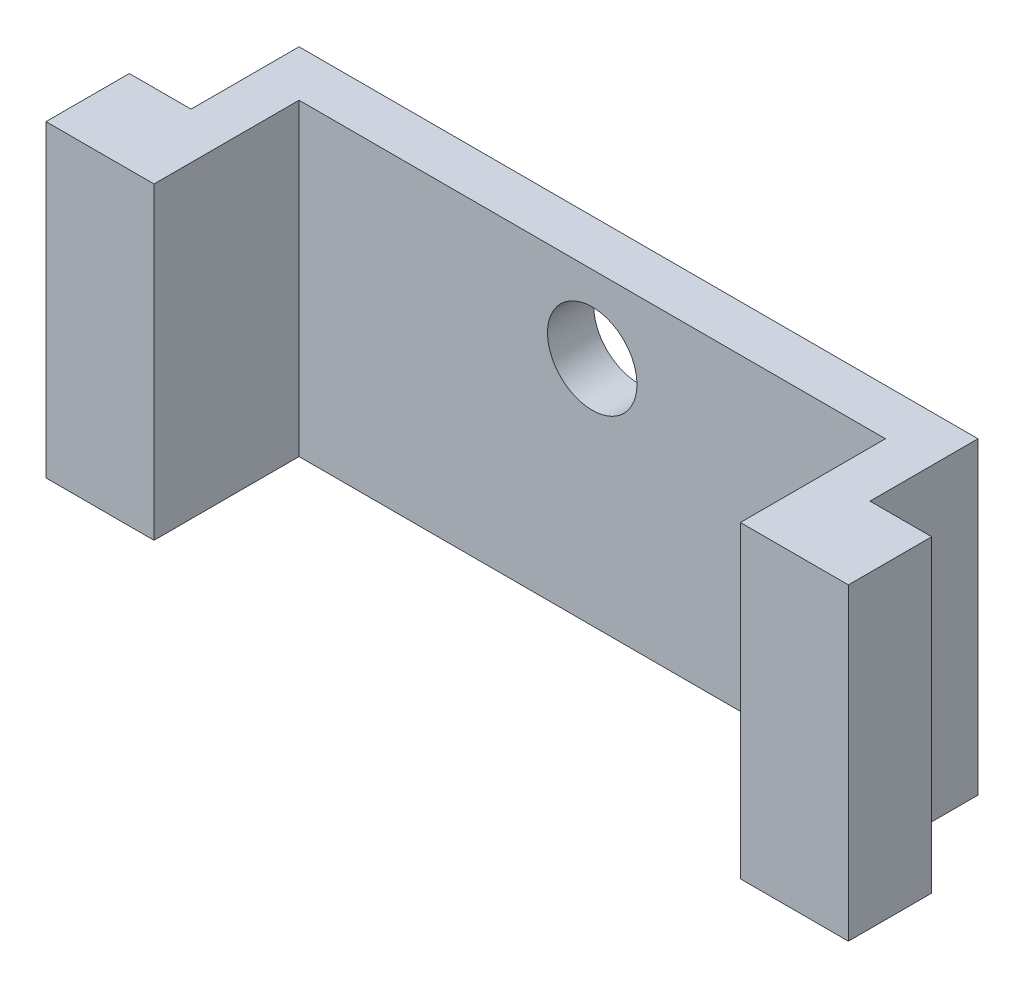
ISO-10303-21;
HEADER;
FILE_DESCRIPTION(('STEP AP214'),'2;1');
FILE_NAME('part.step','',(''),(''),'','','');
FILE_SCHEMA(('AUTOMOTIVE_DESIGN { 1 0 10303 214 1 1 1 1 }'));
ENDSEC;
DATA;
#1=APPLICATION_CONTEXT('core data for automotive mechanical design processes');
#2=APPLICATION_PROTOCOL_DEFINITION('international standard','automotive_design',2000,#1);
#3=PRODUCT_CONTEXT('',#1,'mechanical');
#4=PRODUCT('Part','Part','',(#3));
#5=PRODUCT_RELATED_PRODUCT_CATEGORY('part','',(#4));
#6=PRODUCT_DEFINITION_FORMATION('','',#4);
#7=PRODUCT_DEFINITION_CONTEXT('part definition',#1,'design');
#8=PRODUCT_DEFINITION('design','',#6,#7);
#9=PRODUCT_DEFINITION_SHAPE('','',#8);
#10=(LENGTH_UNIT() NAMED_UNIT(*) SI_UNIT(.MILLI.,.METRE.));
#11=(NAMED_UNIT(*) PLANE_ANGLE_UNIT() SI_UNIT($,.RADIAN.));
#12=(NAMED_UNIT(*) SI_UNIT($,.STERADIAN.) SOLID_ANGLE_UNIT());
#13=UNCERTAINTY_MEASURE_WITH_UNIT(LENGTH_MEASURE(1.E-05),#10,'distance_accuracy_value','');
#14=(GEOMETRIC_REPRESENTATION_CONTEXT(3) GLOBAL_UNCERTAINTY_ASSIGNED_CONTEXT((#13)) GLOBAL_UNIT_ASSIGNED_CONTEXT((#10,
#11,#12)) REPRESENTATION_CONTEXT('',''));
#15=CARTESIAN_POINT('',(0.,0.,0.));
#16=DIRECTION('',(0.,0.,1.));
#17=DIRECTION('',(1.,0.,0.));
#18=AXIS2_PLACEMENT_3D('',#15,#16,#17);
#19=CARTESIAN_POINT('',(0.,5.,5.15679442508711));
#20=DIRECTION('',(0.,0.,-1.));
#21=DIRECTION('',(-1.,0.,0.));
#22=AXIS2_PLACEMENT_3D('',#19,#20,#21);
#23=PLANE('',#22);
#24=CARTESIAN_POINT('',(6.45644599303137,2.5,5.15679442508711));
#25=DIRECTION('',(0.,0.,1.));
#26=DIRECTION('',(1.,0.,0.));
#27=AXIS2_PLACEMENT_3D('',#24,#25,#26);
#28=CIRCLE('',#27,1.45);
#29=CARTESIAN_POINT('',(7.90644599303137,2.5,5.15679442508711));
#30=VERTEX_POINT('',#29);
#31=EDGE_CURVE('E191',#30,#30,#28,.T.);
#32=ORIENTED_EDGE('',*,*,#31,.F.);
#33=EDGE_LOOP('',(#32));
#34=FACE_BOUND('',#33,.T.);
#35=DIRECTION('',(0.,-1.,0.));
#36=VECTOR('',#35,1.);
#37=CARTESIAN_POINT('',(-3.04355400696863,5.,5.15679442508711));
#38=LINE('',#37,#36);
#39=CARTESIAN_POINT('',(-3.04355400696863,5.,5.15679442508711));
#40=VERTEX_POINT('',#39);
#41=CARTESIAN_POINT('',(-3.04355400696863,-5.,5.15679442508711));
#42=VERTEX_POINT('',#41);
#43=EDGE_CURVE('E58',#40,#42,#38,.T.);
#44=ORIENTED_EDGE('',*,*,#43,.T.);
#45=DIRECTION('',(-1.,0.,0.));
#46=VECTOR('',#45,1.);
#47=CARTESIAN_POINT('',(15.9564459930314,-5.,5.15679442508711));
#48=LINE('',#47,#46);
#49=CARTESIAN_POINT('',(15.9564459930314,-5.,5.15679442508711));
#50=VERTEX_POINT('',#49);
#51=EDGE_CURVE('E179',#50,#42,#48,.T.);
#52=ORIENTED_EDGE('',*,*,#51,.F.);
#53=DIRECTION('',(0.,-1.,0.));
#54=VECTOR('',#53,1.);
#55=CARTESIAN_POINT('',(15.9564459930314,5.,5.15679442508711));
#56=LINE('',#55,#54);
#57=CARTESIAN_POINT('',(15.9564459930314,5.,5.15679442508711));
#58=VERTEX_POINT('',#57);
#59=EDGE_CURVE('E11',#58,#50,#56,.T.);
#60=ORIENTED_EDGE('',*,*,#59,.F.);
#61=DIRECTION('',(1.,0.,0.));
#62=VECTOR('',#61,1.);
#63=CARTESIAN_POINT('',(0.,5.,5.15679442508711));
#64=LINE('',#63,#62);
#65=EDGE_CURVE('E205',#40,#58,#64,.T.);
#66=ORIENTED_EDGE('',*,*,#65,.F.);
#67=EDGE_LOOP('',(#44,#52,#60,#66));
#68=FACE_BOUND('',#67,.T.);
#69=ADVANCED_FACE('F35',(#34,#68),#23,.F.);
#70=CARTESIAN_POINT('',(15.9564459930314,5.,0.));
#71=DIRECTION('',(1.,0.,0.));
#72=DIRECTION('',(0.,0.,-1.));
#73=AXIS2_PLACEMENT_3D('',#70,#71,#72);
#74=PLANE('',#73);
#75=ORIENTED_EDGE('',*,*,#59,.T.);
#76=DIRECTION('',(0.,0.,-1.));
#77=VECTOR('',#76,1.);
#78=CARTESIAN_POINT('',(15.9564459930314,-5.,9.15679442508711));
#79=LINE('',#78,#77);
#80=CARTESIAN_POINT('',(15.9564459930314,-5.,9.85679442508711));
#81=VERTEX_POINT('',#80);
#82=EDGE_CURVE('E176',#81,#50,#79,.T.);
#83=ORIENTED_EDGE('',*,*,#82,.F.);
#84=DIRECTION('',(0.,-1.,0.));
#85=VECTOR('',#84,1.);
#86=CARTESIAN_POINT('',(15.9564459930314,5.,9.85679442508711));
#87=LINE('',#86,#85);
#88=CARTESIAN_POINT('',(15.9564459930314,5.,9.85679442508711));
#89=VERTEX_POINT('',#88);
#90=EDGE_CURVE('E156',#89,#81,#87,.T.);
#91=ORIENTED_EDGE('',*,*,#90,.F.);
#92=DIRECTION('',(0.,0.,1.));
#93=VECTOR('',#92,1.);
#94=CARTESIAN_POINT('',(15.9564459930314,5.,0.));
#95=LINE('',#94,#93);
#96=EDGE_CURVE('E208',#58,#89,#95,.T.);
#97=ORIENTED_EDGE('',*,*,#96,.F.);
#98=EDGE_LOOP('',(#75,#83,#91,#97));
#99=FACE_BOUND('',#98,.T.);
#100=ADVANCED_FACE('F249',(#99),#74,.F.);
#101=CARTESIAN_POINT('',(17.4564459930314,5.,0.));
#102=DIRECTION('',(-1.,0.,0.));
#103=DIRECTION('',(0.,0.,1.));
#104=AXIS2_PLACEMENT_3D('',#101,#102,#103);
#105=PLANE('',#104);
#106=DIRECTION('',(0.,0.,-1.));
#107=VECTOR('',#106,1.);
#108=CARTESIAN_POINT('',(17.4564459930314,5.,0.));
#109=LINE('',#108,#107);
#110=CARTESIAN_POINT('',(17.4564459930314,5.,7.15679442508711));
#111=VERTEX_POINT('',#110);
#112=CARTESIAN_POINT('',(17.4564459930314,5.,3.65679442508711));
#113=VERTEX_POINT('',#112);
#114=EDGE_CURVE('E210',#111,#113,#109,.T.);
#115=ORIENTED_EDGE('',*,*,#114,.F.);
#116=DIRECTION('',(0.,-1.,0.));
#117=VECTOR('',#116,1.);
#118=CARTESIAN_POINT('',(17.4564459930314,5.,7.15679442508711));
#119=LINE('',#118,#117);
#120=CARTESIAN_POINT('',(17.4564459930314,-5.,7.15679442508711));
#121=VERTEX_POINT('',#120);
#122=EDGE_CURVE('E199',#111,#121,#119,.T.);
#123=ORIENTED_EDGE('',*,*,#122,.T.);
#124=DIRECTION('',(0.,0.,1.));
#125=VECTOR('',#124,1.);
#126=CARTESIAN_POINT('',(17.4564459930314,-5.,3.65679442508711));
#127=LINE('',#126,#125);
#128=CARTESIAN_POINT('',(17.4564459930314,-5.,3.65679442508711));
#129=VERTEX_POINT('',#128);
#130=EDGE_CURVE('E168',#129,#121,#127,.T.);
#131=ORIENTED_EDGE('',*,*,#130,.F.);
#132=DIRECTION('',(0.,-1.,0.));
#133=VECTOR('',#132,1.);
#134=CARTESIAN_POINT('',(17.4564459930314,5.,3.65679442508711));
#135=LINE('',#134,#133);
#136=EDGE_CURVE('E43',#113,#129,#135,.T.);
#137=ORIENTED_EDGE('',*,*,#136,.F.);
#138=EDGE_LOOP('',(#115,#123,#131,#137));
#139=FACE_BOUND('',#138,.T.);
#140=ADVANCED_FACE('F231',(#139),#105,.F.);
#141=CARTESIAN_POINT('',(0.,5.,3.65679442508711));
#142=DIRECTION('',(0.,0.,-1.));
#143=DIRECTION('',(-1.,0.,0.));
#144=AXIS2_PLACEMENT_3D('',#141,#142,#143);
#145=PLANE('',#144);
#146=CARTESIAN_POINT('',(6.45644599303137,2.5,3.65679442508711));
#147=DIRECTION('',(0.,0.,-1.));
#148=DIRECTION('',(-1.,0.,0.));
#149=AXIS2_PLACEMENT_3D('',#146,#147,#148);
#150=CIRCLE('',#149,1.45);
#151=CARTESIAN_POINT('',(5.00644599303137,2.5,3.65679442508711));
#152=VERTEX_POINT('',#151);
#153=EDGE_CURVE('E38',#152,#152,#150,.T.);
#154=ORIENTED_EDGE('',*,*,#153,.F.);
#155=EDGE_LOOP('',(#154));
#156=FACE_BOUND('',#155,.T.);
#157=ORIENTED_EDGE('',*,*,#136,.T.);
#158=DIRECTION('',(1.,0.,0.));
#159=VECTOR('',#158,1.);
#160=CARTESIAN_POINT('',(-4.54355400696863,-5.,3.65679442508711));
#161=LINE('',#160,#159);
#162=CARTESIAN_POINT('',(-4.54355400696863,-5.,3.65679442508711));
#163=VERTEX_POINT('',#162);
#164=EDGE_CURVE('E165',#163,#129,#161,.T.);
#165=ORIENTED_EDGE('',*,*,#164,.F.);
#166=DIRECTION('',(0.,-1.,0.));
#167=VECTOR('',#166,1.);
#168=CARTESIAN_POINT('',(-4.54355400696863,5.,3.65679442508711));
#169=LINE('',#168,#167);
#170=CARTESIAN_POINT('',(-4.54355400696863,5.,3.65679442508711));
#171=VERTEX_POINT('',#170);
#172=EDGE_CURVE('E220',#171,#163,#169,.T.);
#173=ORIENTED_EDGE('',*,*,#172,.F.);
#174=DIRECTION('',(1.,0.,0.));
#175=VECTOR('',#174,1.);
#176=CARTESIAN_POINT('',(0.,5.,3.65679442508711));
#177=LINE('',#176,#175);
#178=EDGE_CURVE('E212',#171,#113,#177,.T.);
#179=ORIENTED_EDGE('',*,*,#178,.T.);
#180=EDGE_LOOP('',(#157,#165,#173,#179));
#181=FACE_BOUND('',#180,.T.);
#182=ADVANCED_FACE('F226',(#156,#181),#145,.T.);
#183=CARTESIAN_POINT('',(-4.54355400696863,5.,0.));
#184=DIRECTION('',(-1.,0.,0.));
#185=DIRECTION('',(0.,0.,1.));
#186=AXIS2_PLACEMENT_3D('',#183,#184,#185);
#187=PLANE('',#186);
#188=DIRECTION('',(0.,-1.,0.));
#189=VECTOR('',#188,1.);
#190=CARTESIAN_POINT('',(-4.54355400696863,5.,7.15679442508711));
#191=LINE('',#190,#189);
#192=CARTESIAN_POINT('',(-4.54355400696863,5.,7.15679442508711));
#193=VERTEX_POINT('',#192);
#194=CARTESIAN_POINT('',(-4.54355400696863,-5.,7.15679442508711));
#195=VERTEX_POINT('',#194);
#196=EDGE_CURVE('E203',#193,#195,#191,.T.);
#197=ORIENTED_EDGE('',*,*,#196,.F.);
#198=DIRECTION('',(0.,0.,-1.));
#199=VECTOR('',#198,1.);
#200=CARTESIAN_POINT('',(-4.54355400696863,5.,0.));
#201=LINE('',#200,#199);
#202=EDGE_CURVE('E215',#193,#171,#201,.T.);
#203=ORIENTED_EDGE('',*,*,#202,.T.);
#204=ORIENTED_EDGE('',*,*,#172,.T.);
#205=DIRECTION('',(0.,0.,-1.));
#206=VECTOR('',#205,1.);
#207=CARTESIAN_POINT('',(-4.54355400696863,-5.,7.15679442508711));
#208=LINE('',#207,#206);
#209=EDGE_CURVE('E188',#195,#163,#208,.T.);
#210=ORIENTED_EDGE('',*,*,#209,.F.);
#211=EDGE_LOOP('',(#197,#203,#204,#210));
#212=FACE_BOUND('',#211,.T.);
#213=ADVANCED_FACE('F239',(#212),#187,.T.);
#214=CARTESIAN_POINT('',(-3.04355400696863,5.,0.));
#215=DIRECTION('',(1.,0.,0.));
#216=DIRECTION('',(0.,0.,-1.));
#217=AXIS2_PLACEMENT_3D('',#214,#215,#216);
#218=PLANE('',#217);
#219=DIRECTION('',(0.,0.,1.));
#220=VECTOR('',#219,1.);
#221=CARTESIAN_POINT('',(-3.04355400696863,5.,0.));
#222=LINE('',#221,#220);
#223=CARTESIAN_POINT('',(-3.04355400696863,5.,9.85679442508711));
#224=VERTEX_POINT('',#223);
#225=EDGE_CURVE('E217',#40,#224,#222,.T.);
#226=ORIENTED_EDGE('',*,*,#225,.T.);
#227=DIRECTION('',(0.,1.,0.));
#228=VECTOR('',#227,1.);
#229=CARTESIAN_POINT('',(-3.04355400696863,-5.,9.85679442508711));
#230=LINE('',#229,#228);
#231=CARTESIAN_POINT('',(-3.04355400696863,-5.,9.85679442508711));
#232=VERTEX_POINT('',#231);
#233=EDGE_CURVE('E148',#232,#224,#230,.T.);
#234=ORIENTED_EDGE('',*,*,#233,.F.);
#235=DIRECTION('',(0.,0.,1.));
#236=VECTOR('',#235,1.);
#237=CARTESIAN_POINT('',(-3.04355400696863,-5.,5.15679442508711));
#238=LINE('',#237,#236);
#239=EDGE_CURVE('E182',#42,#232,#238,.T.);
#240=ORIENTED_EDGE('',*,*,#239,.F.);
#241=ORIENTED_EDGE('',*,*,#43,.F.);
#242=EDGE_LOOP('',(#226,#234,#240,#241));
#243=FACE_BOUND('',#242,.T.);
#244=ADVANCED_FACE('F242',(#243),#218,.T.);
#245=CARTESIAN_POINT('',(0.,5.,0.));
#246=DIRECTION('',(0.,1.,0.));
#247=DIRECTION('',(0.,0.,1.));
#248=AXIS2_PLACEMENT_3D('',#245,#246,#247);
#249=PLANE('',#248);
#250=ORIENTED_EDGE('',*,*,#96,.T.);
#251=DIRECTION('',(-1.,0.,0.));
#252=VECTOR('',#251,1.);
#253=CARTESIAN_POINT('',(19.4564459930314,5.,9.85679442508711));
#254=LINE('',#253,#252);
#255=CARTESIAN_POINT('',(19.4564459930314,5.,9.85679442508711));
#256=VERTEX_POINT('',#255);
#257=EDGE_CURVE('E153',#256,#89,#254,.T.);
#258=ORIENTED_EDGE('',*,*,#257,.F.);
#259=DIRECTION('',(0.,0.,-1.));
#260=VECTOR('',#259,1.);
#261=CARTESIAN_POINT('',(19.4564459930314,5.,9.15679442508711));
#262=LINE('',#261,#260);
#263=CARTESIAN_POINT('',(19.4564459930314,5.,7.15679442508711));
#264=VERTEX_POINT('',#263);
#265=EDGE_CURVE('E194',#256,#264,#262,.T.);
#266=ORIENTED_EDGE('',*,*,#265,.T.);
#267=DIRECTION('',(-1.,0.,0.));
#268=VECTOR('',#267,1.);
#269=CARTESIAN_POINT('',(15.9564459930314,5.,7.15679442508711));
#270=LINE('',#269,#268);
#271=EDGE_CURVE('E50',#264,#111,#270,.T.);
#272=ORIENTED_EDGE('',*,*,#271,.T.);
#273=ORIENTED_EDGE('',*,*,#114,.T.);
#274=ORIENTED_EDGE('',*,*,#178,.F.);
#275=ORIENTED_EDGE('',*,*,#202,.F.);
#276=DIRECTION('',(-1.,0.,0.));
#277=VECTOR('',#276,1.);
#278=CARTESIAN_POINT('',(-3.04355400696863,5.,7.15679442508711));
#279=LINE('',#278,#277);
#280=CARTESIAN_POINT('',(-6.54355400696863,5.,7.15679442508711));
#281=VERTEX_POINT('',#280);
#282=EDGE_CURVE('E130',#193,#281,#279,.T.);
#283=ORIENTED_EDGE('',*,*,#282,.T.);
#284=DIRECTION('',(0.,0.,1.));
#285=VECTOR('',#284,1.);
#286=CARTESIAN_POINT('',(-6.54355400696863,5.,9.15679442508711));
#287=LINE('',#286,#285);
#288=CARTESIAN_POINT('',(-6.54355400696863,5.,9.85679442508711));
#289=VERTEX_POINT('',#288);
#290=EDGE_CURVE('E123',#281,#289,#287,.T.);
#291=ORIENTED_EDGE('',*,*,#290,.T.);
#292=DIRECTION('',(-1.,0.,0.));
#293=VECTOR('',#292,1.);
#294=CARTESIAN_POINT('',(-3.04355400696863,5.,9.85679442508711));
#295=LINE('',#294,#293);
#296=EDGE_CURVE('E128',#224,#289,#295,.T.);
#297=ORIENTED_EDGE('',*,*,#296,.F.);
#298=ORIENTED_EDGE('',*,*,#225,.F.);
#299=ORIENTED_EDGE('',*,*,#65,.T.);
#300=EDGE_LOOP('',(#250,#258,#266,#272,#273,#274,#275,#283,#291,#297,#298,#299));
#301=FACE_BOUND('',#300,.T.);
#302=ADVANCED_FACE('F125',(#301),#249,.T.);
#303=CARTESIAN_POINT('',(-6.54355400696863,0.,9.15679442508711));
#304=DIRECTION('',(-1.,0.,0.));
#305=DIRECTION('',(0.,0.,1.));
#306=AXIS2_PLACEMENT_3D('',#303,#304,#305);
#307=PLANE('',#306);
#308=ORIENTED_EDGE('',*,*,#290,.F.);
#309=DIRECTION('',(0.,1.,0.));
#310=VECTOR('',#309,1.);
#311=CARTESIAN_POINT('',(-6.54355400696863,0.,7.15679442508711));
#312=LINE('',#311,#310);
#313=CARTESIAN_POINT('',(-6.54355400696863,-5.,7.15679442508711));
#314=VERTEX_POINT('',#313);
#315=EDGE_CURVE('E133',#314,#281,#312,.T.);
#316=ORIENTED_EDGE('',*,*,#315,.F.);
#317=DIRECTION('',(0.,0.,-1.));
#318=VECTOR('',#317,1.);
#319=CARTESIAN_POINT('',(-6.54355400696863,-5.,9.15679442508711));
#320=LINE('',#319,#318);
#321=CARTESIAN_POINT('',(-6.54355400696863,-5.,9.85679442508711));
#322=VERTEX_POINT('',#321);
#323=EDGE_CURVE('E139',#322,#314,#320,.T.);
#324=ORIENTED_EDGE('',*,*,#323,.F.);
#325=DIRECTION('',(0.,-1.,0.));
#326=VECTOR('',#325,1.);
#327=CARTESIAN_POINT('',(-6.54355400696863,5.,9.85679442508711));
#328=LINE('',#327,#326);
#329=EDGE_CURVE('E136',#289,#322,#328,.T.);
#330=ORIENTED_EDGE('',*,*,#329,.F.);
#331=EDGE_LOOP('',(#308,#316,#324,#330));
#332=FACE_BOUND('',#331,.T.);
#333=ADVANCED_FACE('F137',(#332),#307,.T.);
#334=CARTESIAN_POINT('',(-3.04355400696863,0.,7.15679442508711));
#335=DIRECTION('',(0.,0.,-1.));
#336=DIRECTION('',(-1.,0.,0.));
#337=AXIS2_PLACEMENT_3D('',#334,#335,#336);
#338=PLANE('',#337);
#339=ORIENTED_EDGE('',*,*,#282,.F.);
#340=ORIENTED_EDGE('',*,*,#196,.T.);
#341=DIRECTION('',(1.,0.,0.));
#342=VECTOR('',#341,1.);
#343=CARTESIAN_POINT('',(-6.54355400696863,-5.,7.15679442508711));
#344=LINE('',#343,#342);
#345=EDGE_CURVE('E185',#314,#195,#344,.T.);
#346=ORIENTED_EDGE('',*,*,#345,.F.);
#347=ORIENTED_EDGE('',*,*,#315,.T.);
#348=EDGE_LOOP('',(#339,#340,#346,#347));
#349=FACE_BOUND('',#348,.T.);
#350=ADVANCED_FACE('F241',(#349),#338,.T.);
#351=CARTESIAN_POINT('',(15.9564459930314,0.,7.15679442508711));
#352=DIRECTION('',(0.,0.,-1.));
#353=DIRECTION('',(-1.,0.,0.));
#354=AXIS2_PLACEMENT_3D('',#351,#352,#353);
#355=PLANE('',#354);
#356=ORIENTED_EDGE('',*,*,#122,.F.);
#357=ORIENTED_EDGE('',*,*,#271,.F.);
#358=DIRECTION('',(0.,1.,0.));
#359=VECTOR('',#358,1.);
#360=CARTESIAN_POINT('',(19.4564459930314,0.,7.15679442508711));
#361=LINE('',#360,#359);
#362=CARTESIAN_POINT('',(19.4564459930314,-5.,7.15679442508711));
#363=VERTEX_POINT('',#362);
#364=EDGE_CURVE('E197',#363,#264,#361,.T.);
#365=ORIENTED_EDGE('',*,*,#364,.F.);
#366=DIRECTION('',(1.,0.,0.));
#367=VECTOR('',#366,1.);
#368=CARTESIAN_POINT('',(17.4564459930314,-5.,7.15679442508711));
#369=LINE('',#368,#367);
#370=EDGE_CURVE('E171',#121,#363,#369,.T.);
#371=ORIENTED_EDGE('',*,*,#370,.F.);
#372=EDGE_LOOP('',(#356,#357,#365,#371));
#373=FACE_BOUND('',#372,.T.);
#374=ADVANCED_FACE('F258',(#373),#355,.T.);
#375=CARTESIAN_POINT('',(19.4564459930314,0.,9.15679442508711));
#376=DIRECTION('',(1.,0.,0.));
#377=DIRECTION('',(0.,0.,-1.));
#378=AXIS2_PLACEMENT_3D('',#375,#376,#377);
#379=PLANE('',#378);
#380=ORIENTED_EDGE('',*,*,#265,.F.);
#381=DIRECTION('',(0.,1.,0.));
#382=VECTOR('',#381,1.);
#383=CARTESIAN_POINT('',(19.4564459930314,-5.,9.85679442508711));
#384=LINE('',#383,#382);
#385=CARTESIAN_POINT('',(19.4564459930314,-5.,9.85679442508711));
#386=VERTEX_POINT('',#385);
#387=EDGE_CURVE('E162',#386,#256,#384,.T.);
#388=ORIENTED_EDGE('',*,*,#387,.F.);
#389=DIRECTION('',(0.,0.,1.));
#390=VECTOR('',#389,1.);
#391=CARTESIAN_POINT('',(19.4564459930314,-5.,7.15679442508711));
#392=LINE('',#391,#390);
#393=EDGE_CURVE('E174',#363,#386,#392,.T.);
#394=ORIENTED_EDGE('',*,*,#393,.F.);
#395=ORIENTED_EDGE('',*,*,#364,.T.);
#396=EDGE_LOOP('',(#380,#388,#394,#395));
#397=FACE_BOUND('',#396,.T.);
#398=ADVANCED_FACE('F256',(#397),#379,.T.);
#399=CARTESIAN_POINT('',(6.45644599303137,2.5,0.156794425087109));
#400=DIRECTION('',(0.,0.,1.));
#401=DIRECTION('',(1.,0.,0.));
#402=AXIS2_PLACEMENT_3D('',#399,#400,#401);
#403=CYLINDRICAL_SURFACE('',#402,1.45);
#404=ORIENTED_EDGE('',*,*,#153,.T.);
#405=EDGE_LOOP('',(#404));
#406=FACE_BOUND('',#405,.T.);
#407=ORIENTED_EDGE('',*,*,#31,.T.);
#408=EDGE_LOOP('',(#407));
#409=FACE_BOUND('',#408,.T.);
#410=ADVANCED_FACE('F266',(#406,#409),#403,.F.);
#411=CARTESIAN_POINT('',(0.,-5.,0.));
#412=DIRECTION('',(0.,-1.,0.));
#413=DIRECTION('',(0.,0.,-1.));
#414=AXIS2_PLACEMENT_3D('',#411,#412,#413);
#415=PLANE('',#414);
#416=ORIENTED_EDGE('',*,*,#164,.T.);
#417=ORIENTED_EDGE('',*,*,#130,.T.);
#418=ORIENTED_EDGE('',*,*,#370,.T.);
#419=ORIENTED_EDGE('',*,*,#393,.T.);
#420=DIRECTION('',(1.,0.,0.));
#421=VECTOR('',#420,1.);
#422=CARTESIAN_POINT('',(15.9564459930314,-5.,9.85679442508711));
#423=LINE('',#422,#421);
#424=EDGE_CURVE('E159',#81,#386,#423,.T.);
#425=ORIENTED_EDGE('',*,*,#424,.F.);
#426=ORIENTED_EDGE('',*,*,#82,.T.);
#427=ORIENTED_EDGE('',*,*,#51,.T.);
#428=ORIENTED_EDGE('',*,*,#239,.T.);
#429=DIRECTION('',(1.,0.,0.));
#430=VECTOR('',#429,1.);
#431=CARTESIAN_POINT('',(-6.54355400696863,-5.,9.85679442508711));
#432=LINE('',#431,#430);
#433=EDGE_CURVE('E143',#322,#232,#432,.T.);
#434=ORIENTED_EDGE('',*,*,#433,.F.);
#435=ORIENTED_EDGE('',*,*,#323,.T.);
#436=ORIENTED_EDGE('',*,*,#345,.T.);
#437=ORIENTED_EDGE('',*,*,#209,.T.);
#438=EDGE_LOOP('',(#416,#417,#418,#419,#425,#426,#427,#428,#434,#435,#436,#437));
#439=FACE_BOUND('',#438,.T.);
#440=ADVANCED_FACE('F234',(#439),#415,.T.);
#441=CARTESIAN_POINT('',(0.,0.,9.85679442508711));
#442=DIRECTION('',(0.,0.,1.));
#443=DIRECTION('',(1.,0.,0.));
#444=AXIS2_PLACEMENT_3D('',#441,#442,#443);
#445=PLANE('',#444);
#446=ORIENTED_EDGE('',*,*,#257,.T.);
#447=ORIENTED_EDGE('',*,*,#90,.T.);
#448=ORIENTED_EDGE('',*,*,#424,.T.);
#449=ORIENTED_EDGE('',*,*,#387,.T.);
#450=EDGE_LOOP('',(#446,#447,#448,#449));
#451=FACE_BOUND('',#450,.T.);
#452=ADVANCED_FACE('F254',(#451),#445,.T.);
#453=CARTESIAN_POINT('',(0.,0.,9.85679442508711));
#454=DIRECTION('',(0.,0.,1.));
#455=DIRECTION('',(1.,0.,0.));
#456=AXIS2_PLACEMENT_3D('',#453,#454,#455);
#457=PLANE('',#456);
#458=ORIENTED_EDGE('',*,*,#296,.T.);
#459=ORIENTED_EDGE('',*,*,#329,.T.);
#460=ORIENTED_EDGE('',*,*,#433,.T.);
#461=ORIENTED_EDGE('',*,*,#233,.T.);
#462=EDGE_LOOP('',(#458,#459,#460,#461));
#463=FACE_BOUND('',#462,.T.);
#464=ADVANCED_FACE('F146',(#463),#457,.T.);
#465=CLOSED_SHELL('',(#69,#100,#140,#182,#213,#244,#302,#333,#350,#374,#398,#410,#440,#452,#464));
#466=MANIFOLD_SOLID_BREP('B2',#465);
#467=ADVANCED_BREP_SHAPE_REPRESENTATION('',(#18,#466),#14);
#468=SHAPE_DEFINITION_REPRESENTATION(#9,#467);
ENDSEC;
END-ISO-10303-21;
